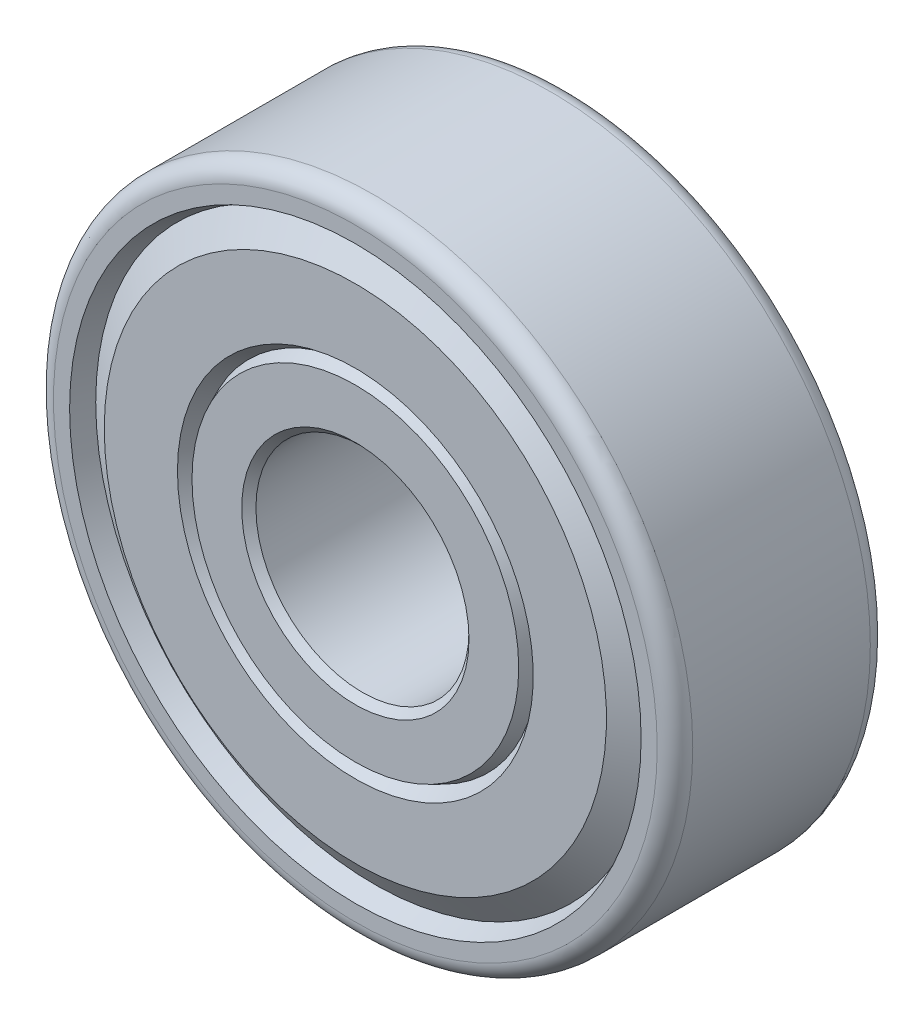
ISO-10303-21;
HEADER;
FILE_DESCRIPTION(('STEP AP214'),'2;1');
FILE_NAME('part.step','',(''),(''),'','','');
FILE_SCHEMA(('AUTOMOTIVE_DESIGN { 1 0 10303 214 1 1 1 1 }'));
ENDSEC;
DATA;
#1=APPLICATION_CONTEXT('core data for automotive mechanical design processes');
#2=APPLICATION_PROTOCOL_DEFINITION('international standard','automotive_design',2000,#1);
#3=PRODUCT_CONTEXT('',#1,'mechanical');
#4=PRODUCT('Part','Part','',(#3));
#5=PRODUCT_RELATED_PRODUCT_CATEGORY('part','',(#4));
#6=PRODUCT_DEFINITION_FORMATION('','',#4);
#7=PRODUCT_DEFINITION_CONTEXT('part definition',#1,'design');
#8=PRODUCT_DEFINITION('design','',#6,#7);
#9=PRODUCT_DEFINITION_SHAPE('','',#8);
#10=(LENGTH_UNIT() NAMED_UNIT(*) SI_UNIT(.MILLI.,.METRE.));
#11=(NAMED_UNIT(*) PLANE_ANGLE_UNIT() SI_UNIT($,.RADIAN.));
#12=(NAMED_UNIT(*) SI_UNIT($,.STERADIAN.) SOLID_ANGLE_UNIT());
#13=UNCERTAINTY_MEASURE_WITH_UNIT(LENGTH_MEASURE(1.E-05),#10,'distance_accuracy_value','');
#14=(GEOMETRIC_REPRESENTATION_CONTEXT(3) GLOBAL_UNCERTAINTY_ASSIGNED_CONTEXT((#13)) GLOBAL_UNIT_ASSIGNED_CONTEXT((#10,
#11,#12)) REPRESENTATION_CONTEXT('',''));
#15=CARTESIAN_POINT('',(0.,0.,0.));
#16=DIRECTION('',(0.,0.,1.));
#17=DIRECTION('',(1.,0.,0.));
#18=AXIS2_PLACEMENT_3D('',#15,#16,#17);
#19=CARTESIAN_POINT('',(0.,0.,-4.60374999999999));
#20=DIRECTION('',(0.,0.,-1.));
#21=DIRECTION('',(-1.,0.,0.));
#22=AXIS2_PLACEMENT_3D('',#19,#20,#21);
#23=CONICAL_SURFACE('',#22,4.92125,0.7853981625);
#24=CARTESIAN_POINT('',(0.,0.,-4.445));
#25=DIRECTION('',(0.,0.,1.));
#26=DIRECTION('',(-1.,0.,0.));
#27=AXIS2_PLACEMENT_3D('',#24,#25,#26);
#28=CIRCLE('',#27,4.7625);
#29=CARTESIAN_POINT('',(4.7625,0.,-4.445));
#30=VERTEX_POINT('',#29);
#31=EDGE_CURVE('E11',#30,#30,#28,.T.);
#32=ORIENTED_EDGE('',*,*,#31,.T.);
#33=EDGE_LOOP('',(#32));
#34=FACE_BOUND('',#33,.T.);
#35=CARTESIAN_POINT('',(0.,0.,-4.7625));
#36=DIRECTION('',(0.,0.,-1.));
#37=DIRECTION('',(-1.,0.,0.));
#38=AXIS2_PLACEMENT_3D('',#35,#36,#37);
#39=CIRCLE('',#38,5.08);
#40=CARTESIAN_POINT('',(5.07999999999997,0.,-4.7625));
#41=VERTEX_POINT('',#40);
#42=EDGE_CURVE('E27',#41,#41,#39,.T.);
#43=ORIENTED_EDGE('',*,*,#42,.T.);
#44=EDGE_LOOP('',(#43));
#45=FACE_BOUND('',#44,.T.);
#46=ADVANCED_FACE('F16',(#34,#45),#23,.F.);
#47=CARTESIAN_POINT('',(0.,0.,0.));
#48=DIRECTION('',(0.,0.,1.));
#49=DIRECTION('',(-1.,0.,0.));
#50=AXIS2_PLACEMENT_3D('',#47,#48,#49);
#51=CYLINDRICAL_SURFACE('',#50,4.7625);
#52=CARTESIAN_POINT('',(0.,0.,4.445));
#53=DIRECTION('',(0.,0.,-1.));
#54=DIRECTION('',(-1.,0.,0.));
#55=AXIS2_PLACEMENT_3D('',#52,#53,#54);
#56=CIRCLE('',#55,4.7625);
#57=CARTESIAN_POINT('',(4.7625,0.,4.445));
#58=VERTEX_POINT('',#57);
#59=EDGE_CURVE('E145',#58,#58,#56,.T.);
#60=ORIENTED_EDGE('',*,*,#59,.F.);
#61=EDGE_LOOP('',(#60));
#62=FACE_BOUND('',#61,.T.);
#63=ORIENTED_EDGE('',*,*,#31,.F.);
#64=EDGE_LOOP('',(#63));
#65=FACE_BOUND('',#64,.T.);
#66=ADVANCED_FACE('F218',(#62,#65),#51,.F.);
#67=CARTESIAN_POINT('',(0.,0.,-4.7625));
#68=DIRECTION('',(0.,0.,-1.));
#69=DIRECTION('',(0.,-1.,0.));
#70=AXIS2_PLACEMENT_3D('',#67,#68,#69);
#71=PLANE('',#70);
#72=CARTESIAN_POINT('',(0.,0.,-4.7625));
#73=DIRECTION('',(0.,0.,-1.));
#74=DIRECTION('',(-1.,0.,0.));
#75=AXIS2_PLACEMENT_3D('',#72,#73,#74);
#76=CIRCLE('',#75,7.3025);
#77=CARTESIAN_POINT('',(-7.30249999999999,0.,-4.7625));
#78=VERTEX_POINT('',#77);
#79=EDGE_CURVE('E149',#78,#78,#76,.T.);
#80=ORIENTED_EDGE('',*,*,#79,.T.);
#81=EDGE_LOOP('',(#80));
#82=FACE_BOUND('',#81,.T.);
#83=ORIENTED_EDGE('',*,*,#42,.F.);
#84=EDGE_LOOP('',(#83));
#85=FACE_BOUND('',#84,.T.);
#86=ADVANCED_FACE('F224',(#82,#85),#71,.T.);
#87=CARTESIAN_POINT('',(0.,0.,4.60375000000002));
#88=DIRECTION('',(0.,0.,1.));
#89=DIRECTION('',(-1.,0.,0.));
#90=AXIS2_PLACEMENT_3D('',#87,#88,#89);
#91=CONICAL_SURFACE('',#90,4.92125,0.7853981625);
#92=ORIENTED_EDGE('',*,*,#59,.T.);
#93=EDGE_LOOP('',(#92));
#94=FACE_BOUND('',#93,.T.);
#95=CARTESIAN_POINT('',(0.,0.,4.7625));
#96=DIRECTION('',(0.,0.,1.));
#97=DIRECTION('',(-1.,0.,0.));
#98=AXIS2_PLACEMENT_3D('',#95,#96,#97);
#99=CIRCLE('',#98,5.08);
#100=CARTESIAN_POINT('',(5.07999999999997,0.,4.7625));
#101=VERTEX_POINT('',#100);
#102=EDGE_CURVE('E52',#101,#101,#99,.T.);
#103=ORIENTED_EDGE('',*,*,#102,.T.);
#104=EDGE_LOOP('',(#103));
#105=FACE_BOUND('',#104,.T.);
#106=ADVANCED_FACE('F213',(#94,#105),#91,.F.);
#107=CARTESIAN_POINT('',(0.,0.,4.7625));
#108=DIRECTION('',(0.,0.,-1.));
#109=DIRECTION('',(0.,-1.,0.));
#110=AXIS2_PLACEMENT_3D('',#107,#108,#109);
#111=PLANE('',#110);
#112=CARTESIAN_POINT('',(0.,0.,4.7625));
#113=DIRECTION('',(0.,0.,1.));
#114=DIRECTION('',(-1.,0.,0.));
#115=AXIS2_PLACEMENT_3D('',#112,#113,#114);
#116=CIRCLE('',#115,7.3025);
#117=CARTESIAN_POINT('',(-7.30249999999999,0.,4.7625));
#118=VERTEX_POINT('',#117);
#119=EDGE_CURVE('E20',#118,#118,#116,.T.);
#120=ORIENTED_EDGE('',*,*,#119,.T.);
#121=EDGE_LOOP('',(#120));
#122=FACE_BOUND('',#121,.T.);
#123=ORIENTED_EDGE('',*,*,#102,.F.);
#124=EDGE_LOOP('',(#123));
#125=FACE_BOUND('',#124,.T.);
#126=ADVANCED_FACE('F206',(#122,#125),#111,.F.);
#127=CARTESIAN_POINT('',(0.,0.,-3.96874999999999));
#128=DIRECTION('',(0.,0.,1.));
#129=DIRECTION('',(1.,0.,0.));
#130=AXIS2_PLACEMENT_3D('',#127,#128,#129);
#131=TOROIDAL_SURFACE('',#130,13.49375,0.79375);
#132=CARTESIAN_POINT('',(0.,0.,-4.7625));
#133=DIRECTION('',(0.,0.,1.));
#134=DIRECTION('',(-1.,0.,0.));
#135=AXIS2_PLACEMENT_3D('',#132,#133,#134);
#136=CIRCLE('',#135,13.49375);
#137=CARTESIAN_POINT('',(13.49375,0.,-4.7625));
#138=VERTEX_POINT('',#137);
#139=EDGE_CURVE('E70',#138,#138,#136,.T.);
#140=ORIENTED_EDGE('',*,*,#139,.T.);
#141=EDGE_LOOP('',(#140));
#142=FACE_BOUND('',#141,.T.);
#143=CARTESIAN_POINT('',(0.,0.,-3.96874999999999));
#144=DIRECTION('',(0.,0.,-1.));
#145=DIRECTION('',(-1.,0.,0.));
#146=AXIS2_PLACEMENT_3D('',#143,#144,#145);
#147=CIRCLE('',#146,14.2875);
#148=CARTESIAN_POINT('',(14.2875,0.,-3.96874999999999));
#149=VERTEX_POINT('',#148);
#150=EDGE_CURVE('E155',#149,#149,#147,.T.);
#151=ORIENTED_EDGE('',*,*,#150,.T.);
#152=EDGE_LOOP('',(#151));
#153=FACE_BOUND('',#152,.T.);
#154=ADVANCED_FACE('F202',(#142,#153),#131,.T.);
#155=CARTESIAN_POINT('',(0.,0.,0.));
#156=DIRECTION('',(0.,0.,1.));
#157=DIRECTION('',(-1.,0.,0.));
#158=AXIS2_PLACEMENT_3D('',#155,#156,#157);
#159=CYLINDRICAL_SURFACE('',#158,14.2875);
#160=CARTESIAN_POINT('',(0.,0.,3.96875000000002));
#161=DIRECTION('',(0.,0.,1.));
#162=DIRECTION('',(-1.,0.,0.));
#163=AXIS2_PLACEMENT_3D('',#160,#161,#162);
#164=CIRCLE('',#163,14.2875);
#165=CARTESIAN_POINT('',(14.2875,0.,3.96874999999999));
#166=VERTEX_POINT('',#165);
#167=EDGE_CURVE('E154',#166,#166,#164,.T.);
#168=ORIENTED_EDGE('',*,*,#167,.F.);
#169=EDGE_LOOP('',(#168));
#170=FACE_BOUND('',#169,.T.);
#171=ORIENTED_EDGE('',*,*,#150,.F.);
#172=EDGE_LOOP('',(#171));
#173=FACE_BOUND('',#172,.T.);
#174=ADVANCED_FACE('F198',(#170,#173),#159,.T.);
#175=CARTESIAN_POINT('',(0.,0.,-4.7625));
#176=DIRECTION('',(0.,0.,-1.));
#177=DIRECTION('',(0.,-1.,0.));
#178=AXIS2_PLACEMENT_3D('',#175,#176,#177);
#179=PLANE('',#178);
#180=ORIENTED_EDGE('',*,*,#139,.F.);
#181=EDGE_LOOP('',(#180));
#182=FACE_BOUND('',#181,.T.);
#183=CARTESIAN_POINT('',(0.,0.,-4.7625));
#184=DIRECTION('',(0.,0.,1.));
#185=DIRECTION('',(-1.,0.,0.));
#186=AXIS2_PLACEMENT_3D('',#183,#184,#185);
#187=CIRCLE('',#186,12.77293681286);
#188=CARTESIAN_POINT('',(-12.77293681286,0.,-4.7625));
#189=VERTEX_POINT('',#188);
#190=EDGE_CURVE('E159',#189,#189,#187,.T.);
#191=ORIENTED_EDGE('',*,*,#190,.T.);
#192=EDGE_LOOP('',(#191));
#193=FACE_BOUND('',#192,.T.);
#194=ADVANCED_FACE('F201',(#182,#193),#179,.T.);
#195=CARTESIAN_POINT('',(0.,0.,3.96875000000002));
#196=DIRECTION('',(0.,0.,-1.));
#197=DIRECTION('',(-1.,0.,0.));
#198=AXIS2_PLACEMENT_3D('',#195,#196,#197);
#199=TOROIDAL_SURFACE('',#198,13.49375,0.79375);
#200=CARTESIAN_POINT('',(0.,0.,4.7625));
#201=DIRECTION('',(0.,0.,-1.));
#202=DIRECTION('',(-1.,0.,0.));
#203=AXIS2_PLACEMENT_3D('',#200,#201,#202);
#204=CIRCLE('',#203,13.49375);
#205=CARTESIAN_POINT('',(13.49375,0.,4.7625));
#206=VERTEX_POINT('',#205);
#207=EDGE_CURVE('E163',#206,#206,#204,.T.);
#208=ORIENTED_EDGE('',*,*,#207,.T.);
#209=EDGE_LOOP('',(#208));
#210=FACE_BOUND('',#209,.T.);
#211=ORIENTED_EDGE('',*,*,#167,.T.);
#212=EDGE_LOOP('',(#211));
#213=FACE_BOUND('',#212,.T.);
#214=ADVANCED_FACE('F196',(#210,#213),#199,.T.);
#215=CARTESIAN_POINT('',(0.,0.,4.7625));
#216=DIRECTION('',(0.,0.,-1.));
#217=DIRECTION('',(0.,-1.,0.));
#218=AXIS2_PLACEMENT_3D('',#215,#216,#217);
#219=PLANE('',#218);
#220=ORIENTED_EDGE('',*,*,#207,.F.);
#221=EDGE_LOOP('',(#220));
#222=FACE_BOUND('',#221,.T.);
#223=CARTESIAN_POINT('',(0.,0.,4.7625));
#224=DIRECTION('',(0.,0.,-1.));
#225=DIRECTION('',(-1.,0.,0.));
#226=AXIS2_PLACEMENT_3D('',#223,#224,#225);
#227=CIRCLE('',#226,12.77293681286);
#228=CARTESIAN_POINT('',(-12.77293681286,0.,4.7625));
#229=VERTEX_POINT('',#228);
#230=EDGE_CURVE('E150',#229,#229,#227,.T.);
#231=ORIENTED_EDGE('',*,*,#230,.T.);
#232=EDGE_LOOP('',(#231));
#233=FACE_BOUND('',#232,.T.);
#234=ADVANCED_FACE('F258',(#222,#233),#219,.F.);
#235=CARTESIAN_POINT('',(0.,0.,-4.7625));
#236=DIRECTION('',(0.,0.,1.));
#237=DIRECTION('',(1.,0.,0.));
#238=AXIS2_PLACEMENT_3D('',#235,#236,#237);
#239=CONICAL_SURFACE('',#238,11.2241326943492,0.969766785990084);
#240=CARTESIAN_POINT('',(0.,0.,-3.93017144225871));
#241=DIRECTION('',(0.,0.,1.));
#242=DIRECTION('',(-1.,0.,0.));
#243=AXIS2_PLACEMENT_3D('',#240,#241,#242);
#244=CIRCLE('',#243,12.4380602466955);
#245=CARTESIAN_POINT('',(-12.4380602466955,0.,-3.93017144225874));
#246=VERTEX_POINT('',#245);
#247=EDGE_CURVE('E100',#246,#246,#244,.T.);
#248=ORIENTED_EDGE('',*,*,#247,.F.);
#249=EDGE_LOOP('',(#248));
#250=FACE_BOUND('',#249,.T.);
#251=CARTESIAN_POINT('',(0.,0.,-4.7625));
#252=DIRECTION('',(0.,0.,-1.));
#253=DIRECTION('',(-1.,0.,0.));
#254=AXIS2_PLACEMENT_3D('',#251,#252,#253);
#255=CIRCLE('',#254,11.2241326943492);
#256=CARTESIAN_POINT('',(-11.2241326943492,0.,-4.7625));
#257=VERTEX_POINT('',#256);
#258=EDGE_CURVE('E111',#257,#257,#255,.T.);
#259=ORIENTED_EDGE('',*,*,#258,.F.);
#260=EDGE_LOOP('',(#259));
#261=FACE_BOUND('',#260,.T.);
#262=ADVANCED_FACE('F252',(#250,#261),#239,.T.);
#263=CARTESIAN_POINT('',(0.,0.,-3.93017144225871));
#264=DIRECTION('',(0.,0.,-1.));
#265=DIRECTION('',(-1.,0.,0.));
#266=AXIS2_PLACEMENT_3D('',#263,#264,#265);
#267=CONICAL_SURFACE('',#266,12.4380602466955,0.382519398268517);
#268=ORIENTED_EDGE('',*,*,#190,.F.);
#269=EDGE_LOOP('',(#268));
#270=FACE_BOUND('',#269,.T.);
#271=ORIENTED_EDGE('',*,*,#247,.T.);
#272=EDGE_LOOP('',(#271));
#273=FACE_BOUND('',#272,.T.);
#274=ADVANCED_FACE('F244',(#270,#273),#267,.F.);
#275=CARTESIAN_POINT('',(0.,0.,-4.7625));
#276=DIRECTION('',(0.,0.,1.));
#277=DIRECTION('',(1.,0.,0.));
#278=AXIS2_PLACEMENT_3D('',#275,#276,#277);
#279=CONICAL_SURFACE('',#278,7.3025,0.407917424824535);
#280=CARTESIAN_POINT('',(0.,0.,-4.18132890087755));
#281=DIRECTION('',(0.,0.,1.));
#282=DIRECTION('',(-1.,0.,0.));
#283=AXIS2_PLACEMENT_3D('',#280,#281,#282);
#284=CIRCLE('',#283,7.55365742462337);
#285=CARTESIAN_POINT('',(-7.55365742462338,0.,-4.18132890087755));
#286=VERTEX_POINT('',#285);
#287=EDGE_CURVE('E172',#286,#286,#284,.T.);
#288=ORIENTED_EDGE('',*,*,#287,.F.);
#289=EDGE_LOOP('',(#288));
#290=FACE_BOUND('',#289,.T.);
#291=ORIENTED_EDGE('',*,*,#79,.F.);
#292=EDGE_LOOP('',(#291));
#293=FACE_BOUND('',#292,.T.);
#294=ADVANCED_FACE('F242',(#290,#293),#279,.T.);
#295=CARTESIAN_POINT('',(0.,0.,-4.18132890087755));
#296=DIRECTION('',(0.,0.,-1.));
#297=DIRECTION('',(-1.,0.,0.));
#298=AXIS2_PLACEMENT_3D('',#295,#296,#297);
#299=CONICAL_SURFACE('',#298,7.55365742462337,0.601029540804805);
#300=CARTESIAN_POINT('',(0.,0.,-4.7625));
#301=DIRECTION('',(0.,0.,1.));
#302=DIRECTION('',(-1.,0.,0.));
#303=AXIS2_PLACEMENT_3D('',#300,#301,#302);
#304=CIRCLE('',#303,7.952136972928);
#305=CARTESIAN_POINT('',(-7.95213697292801,0.,-4.7625));
#306=VERTEX_POINT('',#305);
#307=EDGE_CURVE('E176',#306,#306,#304,.T.);
#308=ORIENTED_EDGE('',*,*,#307,.F.);
#309=EDGE_LOOP('',(#308));
#310=FACE_BOUND('',#309,.T.);
#311=ORIENTED_EDGE('',*,*,#287,.T.);
#312=EDGE_LOOP('',(#311));
#313=FACE_BOUND('',#312,.T.);
#314=ADVANCED_FACE('F18',(#310,#313),#299,.F.);
#315=CARTESIAN_POINT('',(0.,0.,-4.7625));
#316=DIRECTION('',(0.,0.,-1.));
#317=DIRECTION('',(0.,-1.,0.));
#318=AXIS2_PLACEMENT_3D('',#315,#316,#317);
#319=PLANE('',#318);
#320=ORIENTED_EDGE('',*,*,#258,.T.);
#321=EDGE_LOOP('',(#320));
#322=FACE_BOUND('',#321,.T.);
#323=ORIENTED_EDGE('',*,*,#307,.T.);
#324=EDGE_LOOP('',(#323));
#325=FACE_BOUND('',#324,.T.);
#326=ADVANCED_FACE('F250',(#322,#325),#319,.T.);
#327=CARTESIAN_POINT('',(0.,0.,4.34633572112936));
#328=DIRECTION('',(0.,0.,-1.));
#329=DIRECTION('',(-1.,0.,0.));
#330=AXIS2_PLACEMENT_3D('',#327,#328,#329);
#331=CONICAL_SURFACE('',#330,11.8310964705223,0.969766784881962);
#332=CARTESIAN_POINT('',(0.,0.,3.93017144225871));
#333=DIRECTION('',(0.,0.,1.));
#334=DIRECTION('',(-1.,0.,0.));
#335=AXIS2_PLACEMENT_3D('',#332,#333,#334);
#336=CIRCLE('',#335,12.4380602466955);
#337=CARTESIAN_POINT('',(-12.4380602466955,0.,3.93017144225871));
#338=VERTEX_POINT('',#337);
#339=EDGE_CURVE('E180',#338,#338,#336,.T.);
#340=ORIENTED_EDGE('',*,*,#339,.T.);
#341=EDGE_LOOP('',(#340));
#342=FACE_BOUND('',#341,.T.);
#343=CARTESIAN_POINT('',(0.,0.,4.7625));
#344=DIRECTION('',(0.,0.,1.));
#345=DIRECTION('',(-1.,0.,0.));
#346=AXIS2_PLACEMENT_3D('',#343,#344,#345);
#347=CIRCLE('',#346,11.2241326943492);
#348=CARTESIAN_POINT('',(-11.2241326943492,0.,4.7625));
#349=VERTEX_POINT('',#348);
#350=EDGE_CURVE('E133',#349,#349,#347,.T.);
#351=ORIENTED_EDGE('',*,*,#350,.F.);
#352=EDGE_LOOP('',(#351));
#353=FACE_BOUND('',#352,.T.);
#354=ADVANCED_FACE('F261',(#342,#353),#331,.T.);
#355=CARTESIAN_POINT('',(0.,0.,4.34633572112936));
#356=DIRECTION('',(0.,0.,1.));
#357=DIRECTION('',(-1.,0.,0.));
#358=AXIS2_PLACEMENT_3D('',#355,#356,#357);
#359=CONICAL_SURFACE('',#358,12.6054985297777,0.382519397831444);
#360=ORIENTED_EDGE('',*,*,#230,.F.);
#361=EDGE_LOOP('',(#360));
#362=FACE_BOUND('',#361,.T.);
#363=ORIENTED_EDGE('',*,*,#339,.F.);
#364=EDGE_LOOP('',(#363));
#365=FACE_BOUND('',#364,.T.);
#366=ADVANCED_FACE('F232',(#362,#365),#359,.F.);
#367=CARTESIAN_POINT('',(0.,0.,4.47191445043876));
#368=DIRECTION('',(0.,0.,-1.));
#369=DIRECTION('',(-1.,0.,0.));
#370=AXIS2_PLACEMENT_3D('',#367,#368,#369);
#371=CONICAL_SURFACE('',#370,7.4280787123117,0.407917424358415);
#372=CARTESIAN_POINT('',(0.,0.,4.18132890087755));
#373=DIRECTION('',(0.,0.,1.));
#374=DIRECTION('',(-1.,0.,0.));
#375=AXIS2_PLACEMENT_3D('',#372,#373,#374);
#376=CIRCLE('',#375,7.55365742462337);
#377=CARTESIAN_POINT('',(-7.55365742462338,0.,4.18132890087752));
#378=VERTEX_POINT('',#377);
#379=EDGE_CURVE('E140',#378,#378,#376,.T.);
#380=ORIENTED_EDGE('',*,*,#379,.T.);
#381=EDGE_LOOP('',(#380));
#382=FACE_BOUND('',#381,.T.);
#383=ORIENTED_EDGE('',*,*,#119,.F.);
#384=EDGE_LOOP('',(#383));
#385=FACE_BOUND('',#384,.T.);
#386=ADVANCED_FACE('F229',(#382,#385),#371,.T.);
#387=CARTESIAN_POINT('',(0.,0.,4.47191445043876));
#388=DIRECTION('',(0.,0.,1.));
#389=DIRECTION('',(-1.,0.,0.));
#390=AXIS2_PLACEMENT_3D('',#387,#388,#389);
#391=CONICAL_SURFACE('',#390,7.75289719877568,0.601029540118034);
#392=CARTESIAN_POINT('',(0.,0.,4.7625));
#393=DIRECTION('',(0.,0.,-1.));
#394=DIRECTION('',(-1.,0.,0.));
#395=AXIS2_PLACEMENT_3D('',#392,#393,#394);
#396=CIRCLE('',#395,7.952136972928);
#397=CARTESIAN_POINT('',(-7.95213697292801,0.,4.7625));
#398=VERTEX_POINT('',#397);
#399=EDGE_CURVE('E128',#398,#398,#396,.T.);
#400=ORIENTED_EDGE('',*,*,#399,.F.);
#401=EDGE_LOOP('',(#400));
#402=FACE_BOUND('',#401,.T.);
#403=ORIENTED_EDGE('',*,*,#379,.F.);
#404=EDGE_LOOP('',(#403));
#405=FACE_BOUND('',#404,.T.);
#406=ADVANCED_FACE('F129',(#402,#405),#391,.F.);
#407=CARTESIAN_POINT('',(0.,0.,4.7625));
#408=DIRECTION('',(0.,0.,-1.));
#409=DIRECTION('',(0.,-1.,0.));
#410=AXIS2_PLACEMENT_3D('',#407,#408,#409);
#411=PLANE('',#410);
#412=ORIENTED_EDGE('',*,*,#350,.T.);
#413=EDGE_LOOP('',(#412));
#414=FACE_BOUND('',#413,.T.);
#415=ORIENTED_EDGE('',*,*,#399,.T.);
#416=EDGE_LOOP('',(#415));
#417=FACE_BOUND('',#416,.T.);
#418=ADVANCED_FACE('F266',(#414,#417),#411,.F.);
#419=CLOSED_SHELL('',(#46,#66,#86,#106,#126,#154,#174,#194,#214,#234,#262,#274,#294,#314,#326,
#354,#366,#386,#406,#418));
#420=MANIFOLD_SOLID_BREP('B1',#419);
#421=ADVANCED_BREP_SHAPE_REPRESENTATION('',(#18,#420),#14);
#422=SHAPE_DEFINITION_REPRESENTATION(#9,#421);
ENDSEC;
END-ISO-10303-21;
